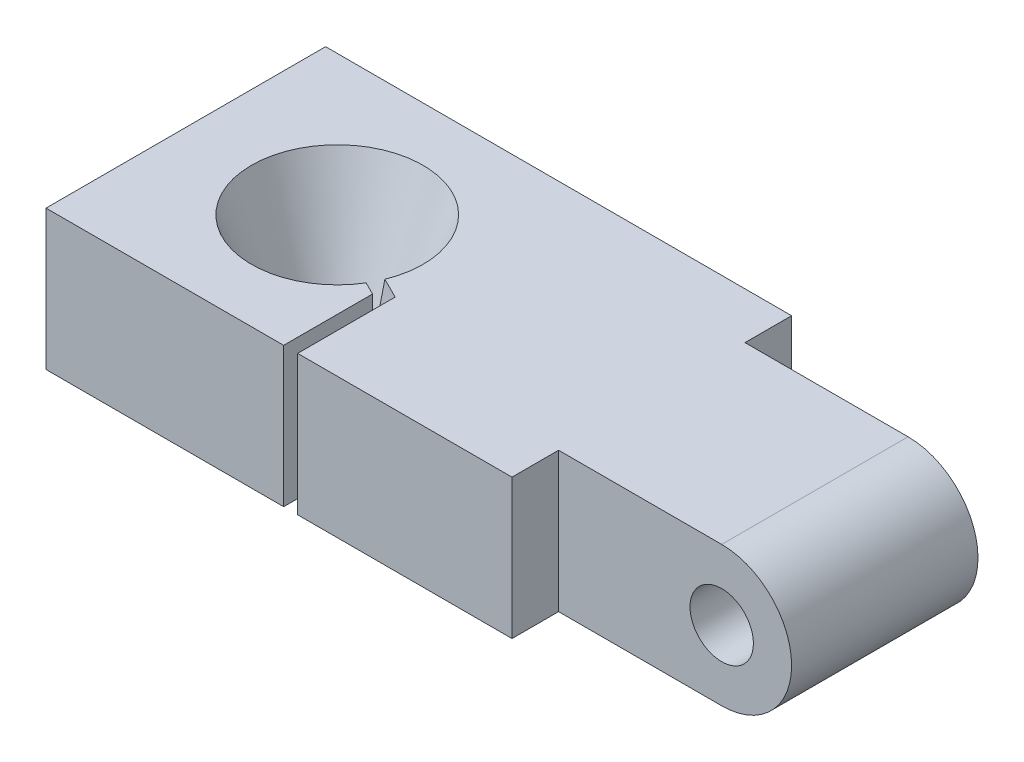
ISO-10303-21;
HEADER;
FILE_DESCRIPTION(('STEP AP214'),'2;1');
FILE_NAME('part.step','',(''),(''),'','','');
FILE_SCHEMA(('AUTOMOTIVE_DESIGN { 1 0 10303 214 1 1 1 1 }'));
ENDSEC;
DATA;
#1=APPLICATION_CONTEXT('core data for automotive mechanical design processes');
#2=APPLICATION_PROTOCOL_DEFINITION('international standard','automotive_design',2000,#1);
#3=PRODUCT_CONTEXT('',#1,'mechanical');
#4=PRODUCT('Part','Part','',(#3));
#5=PRODUCT_RELATED_PRODUCT_CATEGORY('part','',(#4));
#6=PRODUCT_DEFINITION_FORMATION('','',#4);
#7=PRODUCT_DEFINITION_CONTEXT('part definition',#1,'design');
#8=PRODUCT_DEFINITION('design','',#6,#7);
#9=PRODUCT_DEFINITION_SHAPE('','',#8);
#10=(LENGTH_UNIT() NAMED_UNIT(*) SI_UNIT(.MILLI.,.METRE.));
#11=(NAMED_UNIT(*) PLANE_ANGLE_UNIT() SI_UNIT($,.RADIAN.));
#12=(NAMED_UNIT(*) SI_UNIT($,.STERADIAN.) SOLID_ANGLE_UNIT());
#13=UNCERTAINTY_MEASURE_WITH_UNIT(LENGTH_MEASURE(1.E-05),#10,'distance_accuracy_value','');
#14=(GEOMETRIC_REPRESENTATION_CONTEXT(3) GLOBAL_UNCERTAINTY_ASSIGNED_CONTEXT((#13)) GLOBAL_UNIT_ASSIGNED_CONTEXT((#10,
#11,#12)) REPRESENTATION_CONTEXT('',''));
#15=CARTESIAN_POINT('',(0.,0.,0.));
#16=DIRECTION('',(0.,0.,1.));
#17=DIRECTION('',(1.,0.,0.));
#18=AXIS2_PLACEMENT_3D('',#15,#16,#17);
#19=CARTESIAN_POINT('',(-17.145,3.81,12.7));
#20=DIRECTION('',(0.,0.,1.));
#21=DIRECTION('',(1.,0.,0.));
#22=AXIS2_PLACEMENT_3D('',#19,#20,#21);
#23=PLANE('',#22);
#24=DIRECTION('',(0.,-1.,0.));
#25=VECTOR('',#24,1.);
#26=CARTESIAN_POINT('',(-4.191,3.81,12.7));
#27=LINE('',#26,#25);
#28=CARTESIAN_POINT('',(-4.191,3.81,12.7));
#29=VERTEX_POINT('',#28);
#30=CARTESIAN_POINT('',(-4.191,-3.81,12.7));
#31=VERTEX_POINT('',#30);
#32=EDGE_CURVE('E152',#29,#31,#27,.T.);
#33=ORIENTED_EDGE('',*,*,#32,.F.);
#34=DIRECTION('',(-1.,0.,0.));
#35=VECTOR('',#34,1.);
#36=CARTESIAN_POINT('',(-17.145,3.81,12.7));
#37=LINE('',#36,#35);
#38=CARTESIAN_POINT('',(-17.145,3.81,12.7));
#39=VERTEX_POINT('',#38);
#40=EDGE_CURVE('E168',#29,#39,#37,.T.);
#41=ORIENTED_EDGE('',*,*,#40,.T.);
#42=DIRECTION('',(0.,-1.,0.));
#43=VECTOR('',#42,1.);
#44=CARTESIAN_POINT('',(-17.145,3.81,12.7));
#45=LINE('',#44,#43);
#46=CARTESIAN_POINT('',(-17.145,-3.81,12.7));
#47=VERTEX_POINT('',#46);
#48=EDGE_CURVE('E180',#39,#47,#45,.T.);
#49=ORIENTED_EDGE('',*,*,#48,.T.);
#50=DIRECTION('',(-1.,0.,0.));
#51=VECTOR('',#50,1.);
#52=CARTESIAN_POINT('',(-17.145,-3.81,12.7));
#53=LINE('',#52,#51);
#54=EDGE_CURVE('E179',#31,#47,#53,.T.);
#55=ORIENTED_EDGE('',*,*,#54,.F.);
#56=EDGE_LOOP('',(#33,#41,#49,#55));
#57=FACE_BOUND('',#56,.T.);
#58=ADVANCED_FACE('F32',(#57),#23,.T.);
#59=CARTESIAN_POINT('',(-8.89,-3.81,5.08));
#60=DIRECTION('',(0.,1.,0.));
#61=DIRECTION('',(0.,0.,1.));
#62=AXIS2_PLACEMENT_3D('',#59,#60,#61);
#63=CONICAL_SURFACE('',#62,1.905,0.349065850398867);
#64=CARTESIAN_POINT('',(-6.97073195171739,-2.5402,6.46560497385502));
#65=CARTESIAN_POINT('',(-6.87975798047669,-2.2643744549834,6.51109195947537));
#66=CARTESIAN_POINT('',(-6.78890864528803,-1.98849759486768,6.5565166270697));
#67=CARTESIAN_POINT('',(-6.60740035808639,-1.43666566103709,6.64727077067052));
#68=CARTESIAN_POINT('',(-6.51674140602968,-1.16071058734018,6.69260024669887));
#69=CARTESIAN_POINT('',(-6.2449618215127,-0.332764763626756,6.82849003895736));
#70=CARTESIAN_POINT('',(-6.06403836754824,0.219306871873948,6.91895176593959));
#71=CARTESIAN_POINT('',(-5.71746976803003,1.27781850637391,7.0922360656987));
#72=CARTESIAN_POINT('',(-5.55180094516551,1.78424882011404,7.17507047713096));
#73=CARTESIAN_POINT('',(-5.2206347929121,2.79717980802612,7.34065355325766));
#74=CARTESIAN_POINT('',(-5.05513746360369,3.30368048223096,7.42340221791187));
#75=CARTESIAN_POINT('',(-4.88968634424389,3.8102,7.50612777759177));
#76=B_SPLINE_CURVE_WITH_KNOTS('',3,(#64,#65,#66,#67,#68,#69,#70,#71,#72,#73,#74,#75),
.UNSPECIFIED.,.F.,.F.,(4,2,2,2,2,4),(0.,0.881944052723405,1.76388790287527,3.52777469889749,
5.14549350871093,6.76321307737638),.UNSPECIFIED.);
#77=CARTESIAN_POINT('',(-6.97066598268337,-2.54,6.46563795837203));
#78=VERTEX_POINT('',#77);
#79=CARTESIAN_POINT('',(-4.889751670197,3.81,7.50609511461522));
#80=VERTEX_POINT('',#79);
#81=EDGE_CURVE('E358',#78,#80,#76,.T.);
#82=ORIENTED_EDGE('',*,*,#81,.F.);
#83=CARTESIAN_POINT('',(-8.89,-2.54,5.08));
#84=DIRECTION('',(0.,-1.,0.));
#85=DIRECTION('',(0.,0.,-1.));
#86=AXIS2_PLACEMENT_3D('',#83,#84,#85);
#87=CIRCLE('',#86,2.36724219751808);
#88=CARTESIAN_POINT('',(-6.6298892229124,-2.54,5.78408443883009));
#89=VERTEX_POINT('',#88);
#90=EDGE_CURVE('E217',#78,#89,#87,.T.);
#91=ORIENTED_EDGE('',*,*,#90,.T.);
#92=CARTESIAN_POINT('',(-4.54890958447292,3.8102,6.82457425804983));
#93=CARTESIAN_POINT('',(-4.7218367409897,3.28079805210619,6.73811067979144));
#94=CARTESIAN_POINT('',(-4.89481231584727,2.75141583832272,6.65162289236266));
#95=CARTESIAN_POINT('',(-5.2409546509657,1.69272985818237,6.47855172480344));
#96=CARTESIAN_POINT('',(-5.41412141112991,1.163426091786,6.39196834472134));
#97=CARTESIAN_POINT('',(-5.76074071720354,0.10493521523958,6.21865869168452));
#98=CARTESIAN_POINT('',(-5.93419326324003,-0.42425189485848,6.13193241866628));
#99=CARTESIAN_POINT('',(-6.19474483638332,-1.2178797780843,6.00165663209463));
#100=CARTESIAN_POINT('',(-6.28165750845716,-1.4823970090011,5.95820029605771));
#101=CARTESIAN_POINT('',(-6.45566013568215,-2.0113586304929,5.87119898244522));
#102=CARTESIAN_POINT('',(-6.54275009087165,-2.27580302105214,5.82765400485047));
#103=CARTESIAN_POINT('',(-6.62995519194642,-2.54019999999999,5.78405145431308));
#104=B_SPLINE_CURVE_WITH_KNOTS('',3,(#92,#93,#94,#95,#96,#97,#98,#99,#100,#101,#102,#103),
.UNSPECIFIED.,.F.,.F.,(4,2,2,2,2,4),(0.,1.69080327544788,3.38160569669245,5.07240886996126,
5.91781088388885,6.76321308068824),.UNSPECIFIED.);
#105=CARTESIAN_POINT('',(-4.54897491042603,3.81,6.82454159507328));
#106=VERTEX_POINT('',#105);
#107=EDGE_CURVE('E265',#106,#89,#104,.T.);
#108=ORIENTED_EDGE('',*,*,#107,.F.);
#109=CARTESIAN_POINT('',(-8.89,3.81,5.08));
#110=DIRECTION('',(0.,1.,0.));
#111=DIRECTION('',(0.,0.,1.));
#112=AXIS2_PLACEMENT_3D('',#109,#110,#111);
#113=CIRCLE('',#112,4.67845318510847);
#114=EDGE_CURVE('E220',#106,#80,#113,.T.);
#115=ORIENTED_EDGE('',*,*,#114,.T.);
#116=EDGE_LOOP('',(#82,#91,#108,#115));
#117=FACE_BOUND('',#116,.T.);
#118=ADVANCED_FACE('F278',(#117),#63,.F.);
#119=CARTESIAN_POINT('',(-17.145,3.81,10.16));
#120=DIRECTION('',(0.,-1.,0.));
#121=DIRECTION('',(0.,0.,-1.));
#122=AXIS2_PLACEMENT_3D('',#119,#120,#121);
#123=PLANE('',#122);
#124=ORIENTED_EDGE('',*,*,#40,.F.);
#125=DIRECTION('',(0.,0.,1.));
#126=VECTOR('',#125,1.);
#127=CARTESIAN_POINT('',(-4.191,3.81,12.7));
#128=LINE('',#127,#126);
#129=CARTESIAN_POINT('',(-4.191,3.81,7.85547094971371));
#130=VERTEX_POINT('',#129);
#131=EDGE_CURVE('E47',#130,#29,#128,.T.);
#132=ORIENTED_EDGE('',*,*,#131,.F.);
#133=DIRECTION('',(0.894427190999916,0.,0.447213595499958));
#134=VECTOR('',#133,1.);
#135=CARTESIAN_POINT('',(-4.191,3.81,7.85547094971371));
#136=LINE('',#135,#134);
#137=EDGE_CURVE('E369',#80,#130,#136,.T.);
#138=ORIENTED_EDGE('',*,*,#137,.F.);
#139=ORIENTED_EDGE('',*,*,#114,.F.);
#140=DIRECTION('',(-0.894427190999916,0.,-0.447213595499958));
#141=VECTOR('',#140,1.);
#142=CARTESIAN_POINT('',(-3.429,3.81,7.38452905028629));
#143=LINE('',#142,#141);
#144=CARTESIAN_POINT('',(-3.429,3.81,7.38452905028629));
#145=VERTEX_POINT('',#144);
#146=EDGE_CURVE('E162',#145,#106,#143,.T.);
#147=ORIENTED_EDGE('',*,*,#146,.F.);
#148=DIRECTION('',(0.,0.,-1.));
#149=VECTOR('',#148,1.);
#150=CARTESIAN_POINT('',(-3.429,3.81,12.7));
#151=LINE('',#150,#149);
#152=CARTESIAN_POINT('',(-3.429,3.81,12.7));
#153=VERTEX_POINT('',#152);
#154=EDGE_CURVE('E146',#153,#145,#151,.T.);
#155=ORIENTED_EDGE('',*,*,#154,.F.);
#156=CARTESIAN_POINT('',(8.255,3.81,12.7));
#157=VERTEX_POINT('',#156);
#158=EDGE_CURVE('E160',#157,#153,#37,.T.);
#159=ORIENTED_EDGE('',*,*,#158,.F.);
#160=DIRECTION('',(0.,0.,1.));
#161=VECTOR('',#160,1.);
#162=CARTESIAN_POINT('',(8.255,3.81,10.16));
#163=LINE('',#162,#161);
#164=CARTESIAN_POINT('',(8.255,3.81,10.16));
#165=VERTEX_POINT('',#164);
#166=EDGE_CURVE('E172',#165,#157,#163,.T.);
#167=ORIENTED_EDGE('',*,*,#166,.F.);
#168=DIRECTION('',(-1.,0.,0.));
#169=VECTOR('',#168,1.);
#170=CARTESIAN_POINT('',(-17.145,3.81,10.16));
#171=LINE('',#170,#169);
#172=CARTESIAN_POINT('',(17.145,3.81,10.16));
#173=VERTEX_POINT('',#172);
#174=EDGE_CURVE('E221',#173,#165,#171,.T.);
#175=ORIENTED_EDGE('',*,*,#174,.F.);
#176=DIRECTION('',(0.,0.,-1.));
#177=VECTOR('',#176,1.);
#178=CARTESIAN_POINT('',(17.145,3.81,10.16));
#179=LINE('',#178,#177);
#180=CARTESIAN_POINT('',(17.145,3.81,0.));
#181=VERTEX_POINT('',#180);
#182=EDGE_CURVE('E153',#173,#181,#179,.T.);
#183=ORIENTED_EDGE('',*,*,#182,.T.);
#184=DIRECTION('',(-1.,0.,0.));
#185=VECTOR('',#184,1.);
#186=CARTESIAN_POINT('',(-17.145,3.81,0.));
#187=LINE('',#186,#185);
#188=CARTESIAN_POINT('',(8.25499999999998,3.81,0.));
#189=VERTEX_POINT('',#188);
#190=EDGE_CURVE('E200',#181,#189,#187,.T.);
#191=ORIENTED_EDGE('',*,*,#190,.T.);
#192=DIRECTION('',(0.,0.,1.));
#193=VECTOR('',#192,1.);
#194=CARTESIAN_POINT('',(8.25499999999998,3.81,0.));
#195=LINE('',#194,#193);
#196=CARTESIAN_POINT('',(8.25499999999998,3.81,-2.54));
#197=VERTEX_POINT('',#196);
#198=EDGE_CURVE('E360',#197,#189,#195,.T.);
#199=ORIENTED_EDGE('',*,*,#198,.F.);
#200=DIRECTION('',(1.,0.,0.));
#201=VECTOR('',#200,1.);
#202=CARTESIAN_POINT('',(-17.145,3.81,-2.54));
#203=LINE('',#202,#201);
#204=CARTESIAN_POINT('',(-17.145,3.81,-2.54));
#205=VERTEX_POINT('',#204);
#206=EDGE_CURVE('E330',#205,#197,#203,.T.);
#207=ORIENTED_EDGE('',*,*,#206,.F.);
#208=DIRECTION('',(0.,0.,-1.));
#209=VECTOR('',#208,1.);
#210=CARTESIAN_POINT('',(-17.145,3.81,10.16));
#211=LINE('',#210,#209);
#212=EDGE_CURVE('E213',#39,#205,#211,.T.);
#213=ORIENTED_EDGE('',*,*,#212,.F.);
#214=EDGE_LOOP('',(#124,#132,#138,#139,#147,#155,#159,#167,#175,#183,#191,#199,#207,#213));
#215=FACE_BOUND('',#214,.T.);
#216=ADVANCED_FACE('F158',(#215),#123,.F.);
#217=CARTESIAN_POINT('',(-17.145,-3.81,10.16));
#218=DIRECTION('',(0.,1.,0.));
#219=DIRECTION('',(0.,0.,1.));
#220=AXIS2_PLACEMENT_3D('',#217,#218,#219);
#221=PLANE('',#220);
#222=DIRECTION('',(0.894427190999916,0.,0.447213595499958));
#223=VECTOR('',#222,1.);
#224=CARTESIAN_POINT('',(-13.6323883798855,-3.81,3.13477675977097));
#225=LINE('',#224,#223);
#226=CARTESIAN_POINT('',(-5.38440195444809,-3.81,7.25876997248967));
#227=VERTEX_POINT('',#226);
#228=CARTESIAN_POINT('',(-4.191,-3.81,7.85547094971371));
#229=VERTEX_POINT('',#228);
#230=EDGE_CURVE('E364',#227,#229,#225,.T.);
#231=ORIENTED_EDGE('',*,*,#230,.T.);
#232=DIRECTION('',(0.,0.,1.));
#233=VECTOR('',#232,1.);
#234=CARTESIAN_POINT('',(-4.191,-3.81,10.16));
#235=LINE('',#234,#233);
#236=EDGE_CURVE('E263',#229,#31,#235,.T.);
#237=ORIENTED_EDGE('',*,*,#236,.T.);
#238=ORIENTED_EDGE('',*,*,#54,.T.);
#239=DIRECTION('',(0.,0.,-1.));
#240=VECTOR('',#239,1.);
#241=CARTESIAN_POINT('',(-17.145,-3.81,10.16));
#242=LINE('',#241,#240);
#243=CARTESIAN_POINT('',(-17.145,-3.81,-2.54));
#244=VERTEX_POINT('',#243);
#245=EDGE_CURVE('E210',#47,#244,#242,.T.);
#246=ORIENTED_EDGE('',*,*,#245,.T.);
#247=DIRECTION('',(1.,0.,0.));
#248=VECTOR('',#247,1.);
#249=CARTESIAN_POINT('',(-17.145,-3.81,-2.54));
#250=LINE('',#249,#248);
#251=CARTESIAN_POINT('',(8.25499999999998,-3.81,-2.54));
#252=VERTEX_POINT('',#251);
#253=EDGE_CURVE('E342',#244,#252,#250,.T.);
#254=ORIENTED_EDGE('',*,*,#253,.T.);
#255=DIRECTION('',(0.,0.,1.));
#256=VECTOR('',#255,1.);
#257=CARTESIAN_POINT('',(8.25499999999998,-3.81,0.));
#258=LINE('',#257,#256);
#259=CARTESIAN_POINT('',(8.25499999999998,-3.81,0.));
#260=VERTEX_POINT('',#259);
#261=EDGE_CURVE('E353',#252,#260,#258,.T.);
#262=ORIENTED_EDGE('',*,*,#261,.T.);
#263=DIRECTION('',(1.,0.,0.));
#264=VECTOR('',#263,1.);
#265=CARTESIAN_POINT('',(-17.145,-3.81,0.));
#266=LINE('',#265,#264);
#267=CARTESIAN_POINT('',(17.145,-3.81,0.));
#268=VERTEX_POINT('',#267);
#269=EDGE_CURVE('E196',#260,#268,#266,.T.);
#270=ORIENTED_EDGE('',*,*,#269,.T.);
#271=DIRECTION('',(0.,0.,-1.));
#272=VECTOR('',#271,1.);
#273=CARTESIAN_POINT('',(17.145,-3.81,10.16));
#274=LINE('',#273,#272);
#275=CARTESIAN_POINT('',(17.145,-3.81,10.16));
#276=VERTEX_POINT('',#275);
#277=EDGE_CURVE('E207',#276,#268,#274,.T.);
#278=ORIENTED_EDGE('',*,*,#277,.F.);
#279=DIRECTION('',(1.,0.,0.));
#280=VECTOR('',#279,1.);
#281=CARTESIAN_POINT('',(-17.145,-3.81,10.16));
#282=LINE('',#281,#280);
#283=CARTESIAN_POINT('',(8.255,-3.81,10.16));
#284=VERTEX_POINT('',#283);
#285=EDGE_CURVE('E211',#284,#276,#282,.T.);
#286=ORIENTED_EDGE('',*,*,#285,.F.);
#287=DIRECTION('',(0.,0.,1.));
#288=VECTOR('',#287,1.);
#289=CARTESIAN_POINT('',(8.255,-3.81,10.16));
#290=LINE('',#289,#288);
#291=CARTESIAN_POINT('',(8.255,-3.81,12.7));
#292=VERTEX_POINT('',#291);
#293=EDGE_CURVE('E344',#284,#292,#290,.T.);
#294=ORIENTED_EDGE('',*,*,#293,.T.);
#295=CARTESIAN_POINT('',(-3.429,-3.81,12.7));
#296=VERTEX_POINT('',#295);
#297=EDGE_CURVE('E177',#292,#296,#53,.T.);
#298=ORIENTED_EDGE('',*,*,#297,.T.);
#299=DIRECTION('',(0.,0.,-1.));
#300=VECTOR('',#299,1.);
#301=CARTESIAN_POINT('',(-3.429,-3.81,10.16));
#302=LINE('',#301,#300);
#303=CARTESIAN_POINT('',(-3.429,-3.81,7.38452905028629));
#304=VERTEX_POINT('',#303);
#305=EDGE_CURVE('E55',#296,#304,#302,.T.);
#306=ORIENTED_EDGE('',*,*,#305,.T.);
#307=DIRECTION('',(-0.894427190999916,0.,-0.447213595499958));
#308=VECTOR('',#307,1.);
#309=CARTESIAN_POINT('',(-13.2916116201145,-3.81,2.45322324022903));
#310=LINE('',#309,#308);
#311=CARTESIAN_POINT('',(-5.04362519467712,-3.81,6.57721645294773));
#312=VERTEX_POINT('',#311);
#313=EDGE_CURVE('E262',#304,#312,#310,.T.);
#314=ORIENTED_EDGE('',*,*,#313,.T.);
#315=CARTESIAN_POINT('',(-8.89,-3.81,5.08));
#316=DIRECTION('',(0.,-1.,0.));
#317=DIRECTION('',(0.,0.,-1.));
#318=AXIS2_PLACEMENT_3D('',#315,#316,#317);
#319=CIRCLE('',#318,4.1275);
#320=EDGE_CURVE('E183',#227,#312,#319,.T.);
#321=ORIENTED_EDGE('',*,*,#320,.F.);
#322=EDGE_LOOP('',(#231,#237,#238,#246,#254,#262,#270,#278,#286,#294,#298,#306,#314,#321));
#323=FACE_BOUND('',#322,.T.);
#324=ADVANCED_FACE('F340',(#323),#221,.F.);
#325=CARTESIAN_POINT('',(17.145,0.,10.16));
#326=DIRECTION('',(0.,0.,-1.));
#327=DIRECTION('',(-1.,0.,0.));
#328=AXIS2_PLACEMENT_3D('',#325,#326,#327);
#329=CYLINDRICAL_SURFACE('',#328,3.81);
#330=CARTESIAN_POINT('',(17.145,0.,0.));
#331=DIRECTION('',(0.,0.,1.));
#332=DIRECTION('',(-1.,0.,0.));
#333=AXIS2_PLACEMENT_3D('',#330,#331,#332);
#334=CIRCLE('',#333,3.81);
#335=EDGE_CURVE('E230',#268,#181,#334,.T.);
#336=ORIENTED_EDGE('',*,*,#335,.T.);
#337=ORIENTED_EDGE('',*,*,#182,.F.);
#338=CARTESIAN_POINT('',(17.145,0.,10.16));
#339=DIRECTION('',(0.,0.,1.));
#340=DIRECTION('',(-1.,0.,0.));
#341=AXIS2_PLACEMENT_3D('',#338,#339,#340);
#342=CIRCLE('',#341,3.81);
#343=EDGE_CURVE('E199',#276,#173,#342,.T.);
#344=ORIENTED_EDGE('',*,*,#343,.F.);
#345=ORIENTED_EDGE('',*,*,#277,.T.);
#346=EDGE_LOOP('',(#336,#337,#344,#345));
#347=FACE_BOUND('',#346,.T.);
#348=ADVANCED_FACE('F34',(#347),#329,.T.);
#349=CARTESIAN_POINT('',(-17.145,-3.81,10.16));
#350=DIRECTION('',(1.,0.,0.));
#351=DIRECTION('',(0.,0.,-1.));
#352=AXIS2_PLACEMENT_3D('',#349,#350,#351);
#353=PLANE('',#352);
#354=ORIENTED_EDGE('',*,*,#212,.T.);
#355=DIRECTION('',(0.,-1.,0.));
#356=VECTOR('',#355,1.);
#357=CARTESIAN_POINT('',(-17.145,3.81,-2.54));
#358=LINE('',#357,#356);
#359=EDGE_CURVE('E175',#205,#244,#358,.T.);
#360=ORIENTED_EDGE('',*,*,#359,.T.);
#361=ORIENTED_EDGE('',*,*,#245,.F.);
#362=ORIENTED_EDGE('',*,*,#48,.F.);
#363=EDGE_LOOP('',(#354,#360,#361,#362));
#364=FACE_BOUND('',#363,.T.);
#365=ADVANCED_FACE('F335',(#364),#353,.F.);
#366=CARTESIAN_POINT('',(17.145,0.,10.16));
#367=DIRECTION('',(0.,0.,-1.));
#368=DIRECTION('',(-1.,0.,0.));
#369=AXIS2_PLACEMENT_3D('',#366,#367,#368);
#370=PLANE('',#369);
#371=CARTESIAN_POINT('',(17.145,0.,10.16));
#372=DIRECTION('',(0.,0.,1.));
#373=DIRECTION('',(1.,0.,0.));
#374=AXIS2_PLACEMENT_3D('',#371,#372,#373);
#375=CIRCLE('',#374,1.72719999999999);
#376=CARTESIAN_POINT('',(18.8722,0.,10.16));
#377=VERTEX_POINT('',#376);
#378=EDGE_CURVE('E238',#377,#377,#375,.T.);
#379=ORIENTED_EDGE('',*,*,#378,.F.);
#380=EDGE_LOOP('',(#379));
#381=FACE_BOUND('',#380,.T.);
#382=ORIENTED_EDGE('',*,*,#174,.T.);
#383=DIRECTION('',(0.,-1.,0.));
#384=VECTOR('',#383,1.);
#385=CARTESIAN_POINT('',(8.255,3.81,10.16));
#386=LINE('',#385,#384);
#387=EDGE_CURVE('E167',#165,#284,#386,.T.);
#388=ORIENTED_EDGE('',*,*,#387,.T.);
#389=ORIENTED_EDGE('',*,*,#285,.T.);
#390=ORIENTED_EDGE('',*,*,#343,.T.);
#391=EDGE_LOOP('',(#382,#388,#389,#390));
#392=FACE_BOUND('',#391,.T.);
#393=ADVANCED_FACE('F387',(#381,#392),#370,.F.);
#394=CARTESIAN_POINT('',(17.145,0.,0.));
#395=DIRECTION('',(0.,0.,-1.));
#396=DIRECTION('',(-1.,0.,0.));
#397=AXIS2_PLACEMENT_3D('',#394,#395,#396);
#398=PLANE('',#397);
#399=DIRECTION('',(0.,-1.,0.));
#400=VECTOR('',#399,1.);
#401=CARTESIAN_POINT('',(8.25499999999998,3.81,0.));
#402=LINE('',#401,#400);
#403=EDGE_CURVE('E346',#189,#260,#402,.T.);
#404=ORIENTED_EDGE('',*,*,#403,.F.);
#405=ORIENTED_EDGE('',*,*,#190,.F.);
#406=ORIENTED_EDGE('',*,*,#335,.F.);
#407=ORIENTED_EDGE('',*,*,#269,.F.);
#408=EDGE_LOOP('',(#404,#405,#406,#407));
#409=FACE_BOUND('',#408,.T.);
#410=CARTESIAN_POINT('',(17.145,0.,0.));
#411=DIRECTION('',(0.,0.,1.));
#412=DIRECTION('',(1.,0.,0.));
#413=AXIS2_PLACEMENT_3D('',#410,#411,#412);
#414=CIRCLE('',#413,1.7272);
#415=CARTESIAN_POINT('',(18.8722,0.,0.));
#416=VERTEX_POINT('',#415);
#417=EDGE_CURVE('E232',#416,#416,#414,.T.);
#418=ORIENTED_EDGE('',*,*,#417,.T.);
#419=EDGE_LOOP('',(#418));
#420=FACE_BOUND('',#419,.T.);
#421=ADVANCED_FACE('F314',(#409,#420),#398,.T.);
#422=CARTESIAN_POINT('',(17.145,0.,10.16));
#423=DIRECTION('',(0.,0.,1.));
#424=DIRECTION('',(1.,0.,0.));
#425=AXIS2_PLACEMENT_3D('',#422,#423,#424);
#426=CYLINDRICAL_SURFACE('',#425,1.72719999999999);
#427=ORIENTED_EDGE('',*,*,#417,.F.);
#428=EDGE_LOOP('',(#427));
#429=FACE_BOUND('',#428,.T.);
#430=ORIENTED_EDGE('',*,*,#378,.T.);
#431=EDGE_LOOP('',(#430));
#432=FACE_BOUND('',#431,.T.);
#433=ADVANCED_FACE('F309',(#429,#432),#426,.F.);
#434=CARTESIAN_POINT('',(-8.89,-2.54,5.08));
#435=DIRECTION('',(0.,-1.,0.));
#436=DIRECTION('',(0.,0.,-1.));
#437=AXIS2_PLACEMENT_3D('',#434,#435,#436);
#438=CYLINDRICAL_SURFACE('',#437,4.1275);
#439=CARTESIAN_POINT('',(-8.89,-2.54,5.08));
#440=DIRECTION('',(0.,-1.,0.));
#441=DIRECTION('',(0.,0.,-1.));
#442=AXIS2_PLACEMENT_3D('',#439,#440,#441);
#443=CIRCLE('',#442,4.1275);
#444=CARTESIAN_POINT('',(-5.38440195444809,-2.54,7.25876997248967));
#445=VERTEX_POINT('',#444);
#446=CARTESIAN_POINT('',(-5.04362519467712,-2.54,6.57721645294773));
#447=VERTEX_POINT('',#446);
#448=EDGE_CURVE('E187',#445,#447,#443,.T.);
#449=ORIENTED_EDGE('',*,*,#448,.F.);
#450=DIRECTION('',(0.,-1.,0.));
#451=VECTOR('',#450,1.);
#452=CARTESIAN_POINT('',(-5.38440195444809,-2.54,7.25876997248967));
#453=LINE('',#452,#451);
#454=EDGE_CURVE('E258',#445,#227,#453,.T.);
#455=ORIENTED_EDGE('',*,*,#454,.T.);
#456=ORIENTED_EDGE('',*,*,#320,.T.);
#457=DIRECTION('',(0.,-1.,0.));
#458=VECTOR('',#457,1.);
#459=CARTESIAN_POINT('',(-5.04362519467712,-2.54,6.57721645294773));
#460=LINE('',#459,#458);
#461=EDGE_CURVE('E259',#312,#447,#460,.F.);
#462=ORIENTED_EDGE('',*,*,#461,.T.);
#463=EDGE_LOOP('',(#449,#455,#456,#462));
#464=FACE_BOUND('',#463,.T.);
#465=ADVANCED_FACE('F257',(#464),#438,.F.);
#466=CARTESIAN_POINT('',(-8.89,-2.54,5.08));
#467=DIRECTION('',(0.,-1.,0.));
#468=DIRECTION('',(0.,0.,-1.));
#469=AXIS2_PLACEMENT_3D('',#466,#467,#468);
#470=PLANE('',#469);
#471=DIRECTION('',(-0.894427190999916,0.,-0.447213595499958));
#472=VECTOR('',#471,1.);
#473=CARTESIAN_POINT('',(-9.06038837988549,-2.54,5.42077675977097));
#474=LINE('',#473,#472);
#475=EDGE_CURVE('E11',#445,#78,#474,.T.);
#476=ORIENTED_EDGE('',*,*,#475,.F.);
#477=ORIENTED_EDGE('',*,*,#448,.T.);
#478=DIRECTION('',(0.894427190999916,0.,0.447213595499958));
#479=VECTOR('',#478,1.);
#480=CARTESIAN_POINT('',(-8.71961162011452,-2.54,4.73922324022903));
#481=LINE('',#480,#479);
#482=EDGE_CURVE('E40',#89,#447,#481,.T.);
#483=ORIENTED_EDGE('',*,*,#482,.F.);
#484=ORIENTED_EDGE('',*,*,#90,.F.);
#485=EDGE_LOOP('',(#476,#477,#483,#484));
#486=FACE_BOUND('',#485,.T.);
#487=ADVANCED_FACE('F255',(#486),#470,.T.);
#488=DIRECTION('',(0.,1.,0.));
#489=VECTOR('',#488,1.);
#490=CARTESIAN_POINT('',(-3.429,3.81,12.7));
#491=LINE('',#490,#489);
#492=EDGE_CURVE('E143',#296,#153,#491,.T.);
#493=ORIENTED_EDGE('',*,*,#492,.F.);
#494=ORIENTED_EDGE('',*,*,#297,.F.);
#495=DIRECTION('',(0.,-1.,0.));
#496=VECTOR('',#495,1.);
#497=CARTESIAN_POINT('',(8.255,3.81,12.7));
#498=LINE('',#497,#496);
#499=EDGE_CURVE('E165',#157,#292,#498,.T.);
#500=ORIENTED_EDGE('',*,*,#499,.F.);
#501=ORIENTED_EDGE('',*,*,#158,.T.);
#502=EDGE_LOOP('',(#493,#494,#500,#501));
#503=FACE_BOUND('',#502,.T.);
#504=ADVANCED_FACE('F164',(#503),#23,.T.);
#505=CARTESIAN_POINT('',(8.255,3.81,10.16));
#506=DIRECTION('',(1.,0.,0.));
#507=DIRECTION('',(0.,0.,-1.));
#508=AXIS2_PLACEMENT_3D('',#505,#506,#507);
#509=PLANE('',#508);
#510=ORIENTED_EDGE('',*,*,#293,.F.);
#511=ORIENTED_EDGE('',*,*,#387,.F.);
#512=ORIENTED_EDGE('',*,*,#166,.T.);
#513=ORIENTED_EDGE('',*,*,#499,.T.);
#514=EDGE_LOOP('',(#510,#511,#512,#513));
#515=FACE_BOUND('',#514,.T.);
#516=ADVANCED_FACE('F297',(#515),#509,.T.);
#517=CARTESIAN_POINT('',(8.25499999999998,3.81,0.));
#518=DIRECTION('',(1.,0.,0.));
#519=DIRECTION('',(0.,0.,-1.));
#520=AXIS2_PLACEMENT_3D('',#517,#518,#519);
#521=PLANE('',#520);
#522=ORIENTED_EDGE('',*,*,#261,.F.);
#523=DIRECTION('',(0.,-1.,0.));
#524=VECTOR('',#523,1.);
#525=CARTESIAN_POINT('',(8.25499999999998,3.81,-2.54));
#526=LINE('',#525,#524);
#527=EDGE_CURVE('E349',#197,#252,#526,.T.);
#528=ORIENTED_EDGE('',*,*,#527,.F.);
#529=ORIENTED_EDGE('',*,*,#198,.T.);
#530=ORIENTED_EDGE('',*,*,#403,.T.);
#531=EDGE_LOOP('',(#522,#528,#529,#530));
#532=FACE_BOUND('',#531,.T.);
#533=ADVANCED_FACE('F294',(#532),#521,.T.);
#534=CARTESIAN_POINT('',(-17.145,3.81,-2.54));
#535=DIRECTION('',(0.,0.,-1.));
#536=DIRECTION('',(-1.,0.,0.));
#537=AXIS2_PLACEMENT_3D('',#534,#535,#536);
#538=PLANE('',#537);
#539=ORIENTED_EDGE('',*,*,#253,.F.);
#540=ORIENTED_EDGE('',*,*,#359,.F.);
#541=ORIENTED_EDGE('',*,*,#206,.T.);
#542=ORIENTED_EDGE('',*,*,#527,.T.);
#543=EDGE_LOOP('',(#539,#540,#541,#542));
#544=FACE_BOUND('',#543,.T.);
#545=ADVANCED_FACE('F293',(#544),#538,.T.);
#546=CARTESIAN_POINT('',(-3.429,-3.81005,12.7));
#547=DIRECTION('',(1.,0.,0.));
#548=DIRECTION('',(0.,0.,-1.));
#549=AXIS2_PLACEMENT_3D('',#546,#547,#548);
#550=PLANE('',#549);
#551=ORIENTED_EDGE('',*,*,#492,.T.);
#552=ORIENTED_EDGE('',*,*,#154,.T.);
#553=DIRECTION('',(0.,1.,0.));
#554=VECTOR('',#553,1.);
#555=CARTESIAN_POINT('',(-3.429,-3.81005,7.38452905028629));
#556=LINE('',#555,#554);
#557=EDGE_CURVE('E370',#304,#145,#556,.T.);
#558=ORIENTED_EDGE('',*,*,#557,.F.);
#559=ORIENTED_EDGE('',*,*,#305,.F.);
#560=EDGE_LOOP('',(#551,#552,#558,#559));
#561=FACE_BOUND('',#560,.T.);
#562=ADVANCED_FACE('F145',(#561),#550,.F.);
#563=CARTESIAN_POINT('',(-3.429,-3.81005,7.38452905028629));
#564=DIRECTION('',(0.447213595499958,0.,-0.894427190999916));
#565=DIRECTION('',(-0.894427190999916,0.,-0.447213595499958));
#566=AXIS2_PLACEMENT_3D('',#563,#564,#565);
#567=PLANE('',#566);
#568=ORIENTED_EDGE('',*,*,#107,.T.);
#569=ORIENTED_EDGE('',*,*,#482,.T.);
#570=ORIENTED_EDGE('',*,*,#461,.F.);
#571=ORIENTED_EDGE('',*,*,#313,.F.);
#572=ORIENTED_EDGE('',*,*,#557,.T.);
#573=ORIENTED_EDGE('',*,*,#146,.T.);
#574=EDGE_LOOP('',(#568,#569,#570,#571,#572,#573));
#575=FACE_BOUND('',#574,.T.);
#576=ADVANCED_FACE('F282',(#575),#567,.F.);
#577=CARTESIAN_POINT('',(-4.191,-3.81005,12.7));
#578=DIRECTION('',(-1.,0.,0.));
#579=DIRECTION('',(0.,0.,1.));
#580=AXIS2_PLACEMENT_3D('',#577,#578,#579);
#581=PLANE('',#580);
#582=DIRECTION('',(0.,1.,0.));
#583=VECTOR('',#582,1.);
#584=CARTESIAN_POINT('',(-4.191,-3.81005,7.85547094971371));
#585=LINE('',#584,#583);
#586=EDGE_CURVE('E368',#229,#130,#585,.T.);
#587=ORIENTED_EDGE('',*,*,#586,.T.);
#588=ORIENTED_EDGE('',*,*,#131,.T.);
#589=ORIENTED_EDGE('',*,*,#32,.T.);
#590=ORIENTED_EDGE('',*,*,#236,.F.);
#591=EDGE_LOOP('',(#587,#588,#589,#590));
#592=FACE_BOUND('',#591,.T.);
#593=ADVANCED_FACE('F287',(#592),#581,.F.);
#594=CARTESIAN_POINT('',(-4.191,-3.81005,7.85547094971371));
#595=DIRECTION('',(-0.447213595499958,0.,0.894427190999916));
#596=DIRECTION('',(0.894427190999916,0.,0.447213595499958));
#597=AXIS2_PLACEMENT_3D('',#594,#595,#596);
#598=PLANE('',#597);
#599=ORIENTED_EDGE('',*,*,#81,.T.);
#600=ORIENTED_EDGE('',*,*,#137,.T.);
#601=ORIENTED_EDGE('',*,*,#586,.F.);
#602=ORIENTED_EDGE('',*,*,#230,.F.);
#603=ORIENTED_EDGE('',*,*,#454,.F.);
#604=ORIENTED_EDGE('',*,*,#475,.T.);
#605=EDGE_LOOP('',(#599,#600,#601,#602,#603,#604));
#606=FACE_BOUND('',#605,.T.);
#607=ADVANCED_FACE('F288',(#606),#598,.F.);
#608=CLOSED_SHELL('',(#58,#118,#216,#324,#348,#365,#393,#421,#433,#465,#487,#504,#516,#533,#545,
#562,#576,#593,#607));
#609=MANIFOLD_SOLID_BREP('B2',#608);
#610=ADVANCED_BREP_SHAPE_REPRESENTATION('',(#18,#609),#14);
#611=SHAPE_DEFINITION_REPRESENTATION(#9,#610);
ENDSEC;
END-ISO-10303-21;
